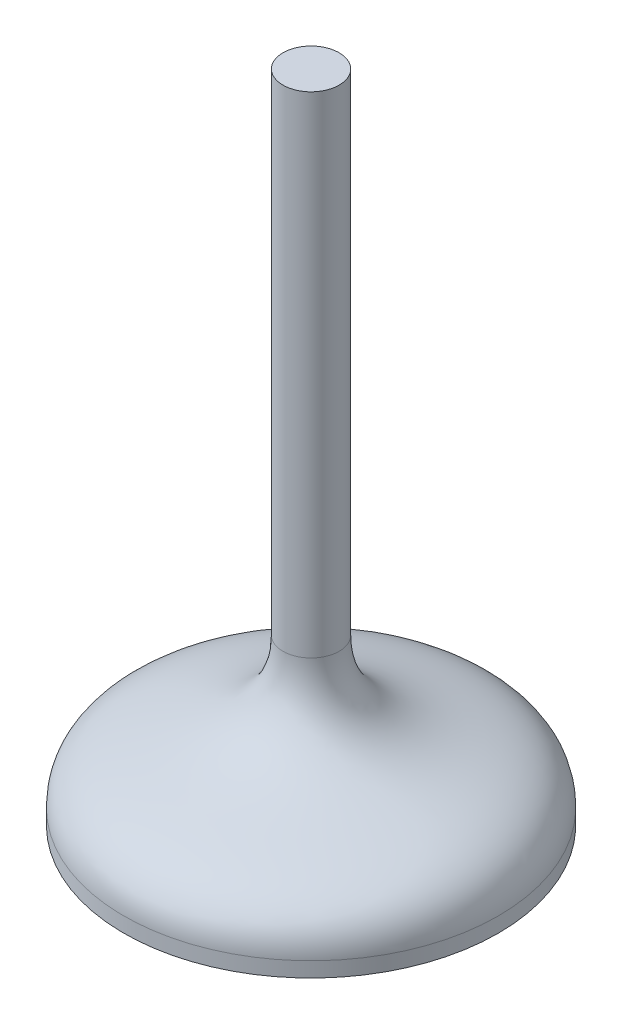
ISO-10303-21;
HEADER;
FILE_DESCRIPTION(('STEP AP214'),'2;1');
FILE_NAME('part.step','',(''),(''),'','','');
FILE_SCHEMA(('AUTOMOTIVE_DESIGN { 1 0 10303 214 1 1 1 1 }'));
ENDSEC;
DATA;
#1=APPLICATION_CONTEXT('core data for automotive mechanical design processes');
#2=APPLICATION_PROTOCOL_DEFINITION('international standard','automotive_design',2000,#1);
#3=PRODUCT_CONTEXT('',#1,'mechanical');
#4=PRODUCT('Part','Part','',(#3));
#5=PRODUCT_RELATED_PRODUCT_CATEGORY('part','',(#4));
#6=PRODUCT_DEFINITION_FORMATION('','',#4);
#7=PRODUCT_DEFINITION_CONTEXT('part definition',#1,'design');
#8=PRODUCT_DEFINITION('design','',#6,#7);
#9=PRODUCT_DEFINITION_SHAPE('','',#8);
#10=(LENGTH_UNIT() NAMED_UNIT(*) SI_UNIT(.MILLI.,.METRE.));
#11=(NAMED_UNIT(*) PLANE_ANGLE_UNIT() SI_UNIT($,.RADIAN.));
#12=(NAMED_UNIT(*) SI_UNIT($,.STERADIAN.) SOLID_ANGLE_UNIT());
#13=UNCERTAINTY_MEASURE_WITH_UNIT(LENGTH_MEASURE(1.E-05),#10,'distance_accuracy_value','');
#14=(GEOMETRIC_REPRESENTATION_CONTEXT(3) GLOBAL_UNCERTAINTY_ASSIGNED_CONTEXT((#13)) GLOBAL_UNIT_ASSIGNED_CONTEXT((#10,
#11,#12)) REPRESENTATION_CONTEXT('',''));
#15=CARTESIAN_POINT('',(0.,0.,0.));
#16=DIRECTION('',(0.,0.,1.));
#17=DIRECTION('',(1.,0.,0.));
#18=AXIS2_PLACEMENT_3D('',#15,#16,#17);
#19=CARTESIAN_POINT('',(-10.,0.8,0.));
#20=CARTESIAN_POINT('',(-10.,5.14378502485188,0.));
#21=CARTESIAN_POINT('',(-1.49999999999999,2.70620491537272,0.));
#22=CARTESIAN_POINT('',(-1.5,8.8,0.));
#23=B_SPLINE_CURVE_WITH_KNOTS('',3,(#19,#20,#21,#22),.UNSPECIFIED.,.F.,.F.,(4,4),(0.,1.),.UNSPECIFIED.);
#24=CARTESIAN_POINT('',(0.,0.,0.));
#25=DIRECTION('',(0.,-1.,0.));
#26=AXIS1_PLACEMENT('',#24,#25);
#27=SURFACE_OF_REVOLUTION('',#23,#26);
#28=CARTESIAN_POINT('',(0.,8.8,0.));
#29=DIRECTION('',(0.,-1.,0.));
#30=DIRECTION('',(1.,0.,0.));
#31=AXIS2_PLACEMENT_3D('',#28,#29,#30);
#32=CIRCLE('',#31,1.5);
#33=CARTESIAN_POINT('',(1.5,8.8,0.));
#34=VERTEX_POINT('',#33);
#35=EDGE_CURVE('E48',#34,#34,#32,.T.);
#36=ORIENTED_EDGE('',*,*,#35,.T.);
#37=EDGE_LOOP('',(#36));
#38=FACE_BOUND('',#37,.T.);
#39=CARTESIAN_POINT('',(0.,0.8,0.));
#40=DIRECTION('',(0.,-1.,0.));
#41=DIRECTION('',(1.,0.,0.));
#42=AXIS2_PLACEMENT_3D('',#39,#40,#41);
#43=CIRCLE('',#42,10.);
#44=CARTESIAN_POINT('',(10.,0.8,0.));
#45=VERTEX_POINT('',#44);
#46=EDGE_CURVE('E10',#45,#45,#43,.T.);
#47=ORIENTED_EDGE('',*,*,#46,.F.);
#48=EDGE_LOOP('',(#47));
#49=FACE_BOUND('',#48,.T.);
#50=ADVANCED_FACE('F33',(#38,#49),#27,.F.);
#51=CARTESIAN_POINT('',(0.,0.,0.));
#52=DIRECTION('',(0.,-1.,0.));
#53=DIRECTION('',(1.,0.,0.));
#54=AXIS2_PLACEMENT_3D('',#51,#52,#53);
#55=CYLINDRICAL_SURFACE('',#54,10.);
#56=ORIENTED_EDGE('',*,*,#46,.T.);
#57=EDGE_LOOP('',(#56));
#58=FACE_BOUND('',#57,.T.);
#59=CARTESIAN_POINT('',(0.,0.,0.));
#60=DIRECTION('',(0.,-1.,0.));
#61=DIRECTION('',(1.,0.,0.));
#62=AXIS2_PLACEMENT_3D('',#59,#60,#61);
#63=CIRCLE('',#62,10.);
#64=CARTESIAN_POINT('',(10.,0.,0.));
#65=VERTEX_POINT('',#64);
#66=EDGE_CURVE('E40',#65,#65,#63,.T.);
#67=ORIENTED_EDGE('',*,*,#66,.F.);
#68=EDGE_LOOP('',(#67));
#69=FACE_BOUND('',#68,.T.);
#70=ADVANCED_FACE('F75',(#58,#69),#55,.T.);
#71=CARTESIAN_POINT('',(0.,0.,0.));
#72=DIRECTION('',(0.,1.,0.));
#73=DIRECTION('',(-1.,0.,0.));
#74=AXIS2_PLACEMENT_3D('',#71,#72,#73);
#75=PLANE('',#74);
#76=ORIENTED_EDGE('',*,*,#66,.T.);
#77=EDGE_LOOP('',(#76));
#78=FACE_BOUND('',#77,.T.);
#79=ADVANCED_FACE('F70',(#78),#75,.F.);
#80=CARTESIAN_POINT('',(0.,35.,0.));
#81=DIRECTION('',(0.,-1.,0.));
#82=DIRECTION('',(1.,0.,0.));
#83=AXIS2_PLACEMENT_3D('',#80,#81,#82);
#84=PLANE('',#83);
#85=CARTESIAN_POINT('',(0.,35.,0.));
#86=DIRECTION('',(0.,-1.,0.));
#87=DIRECTION('',(1.,0.,0.));
#88=AXIS2_PLACEMENT_3D('',#85,#86,#87);
#89=CIRCLE('',#88,1.5);
#90=CARTESIAN_POINT('',(1.5,35.,0.));
#91=VERTEX_POINT('',#90);
#92=EDGE_CURVE('E44',#91,#91,#89,.T.);
#93=ORIENTED_EDGE('',*,*,#92,.F.);
#94=EDGE_LOOP('',(#93));
#95=FACE_BOUND('',#94,.T.);
#96=ADVANCED_FACE('F65',(#95),#84,.F.);
#97=CARTESIAN_POINT('',(0.,0.,0.));
#98=DIRECTION('',(0.,-1.,0.));
#99=DIRECTION('',(1.,0.,0.));
#100=AXIS2_PLACEMENT_3D('',#97,#98,#99);
#101=CYLINDRICAL_SURFACE('',#100,1.5);
#102=ORIENTED_EDGE('',*,*,#35,.F.);
#103=EDGE_LOOP('',(#102));
#104=FACE_BOUND('',#103,.T.);
#105=ORIENTED_EDGE('',*,*,#92,.T.);
#106=EDGE_LOOP('',(#105));
#107=FACE_BOUND('',#106,.T.);
#108=ADVANCED_FACE('F62',(#104,#107),#101,.T.);
#109=CLOSED_SHELL('',(#50,#70,#79,#96,#108));
#110=MANIFOLD_SOLID_BREP('B2',#109);
#111=ADVANCED_BREP_SHAPE_REPRESENTATION('',(#18,#110),#14);
#112=SHAPE_DEFINITION_REPRESENTATION(#9,#111);
ENDSEC;
END-ISO-10303-21;
